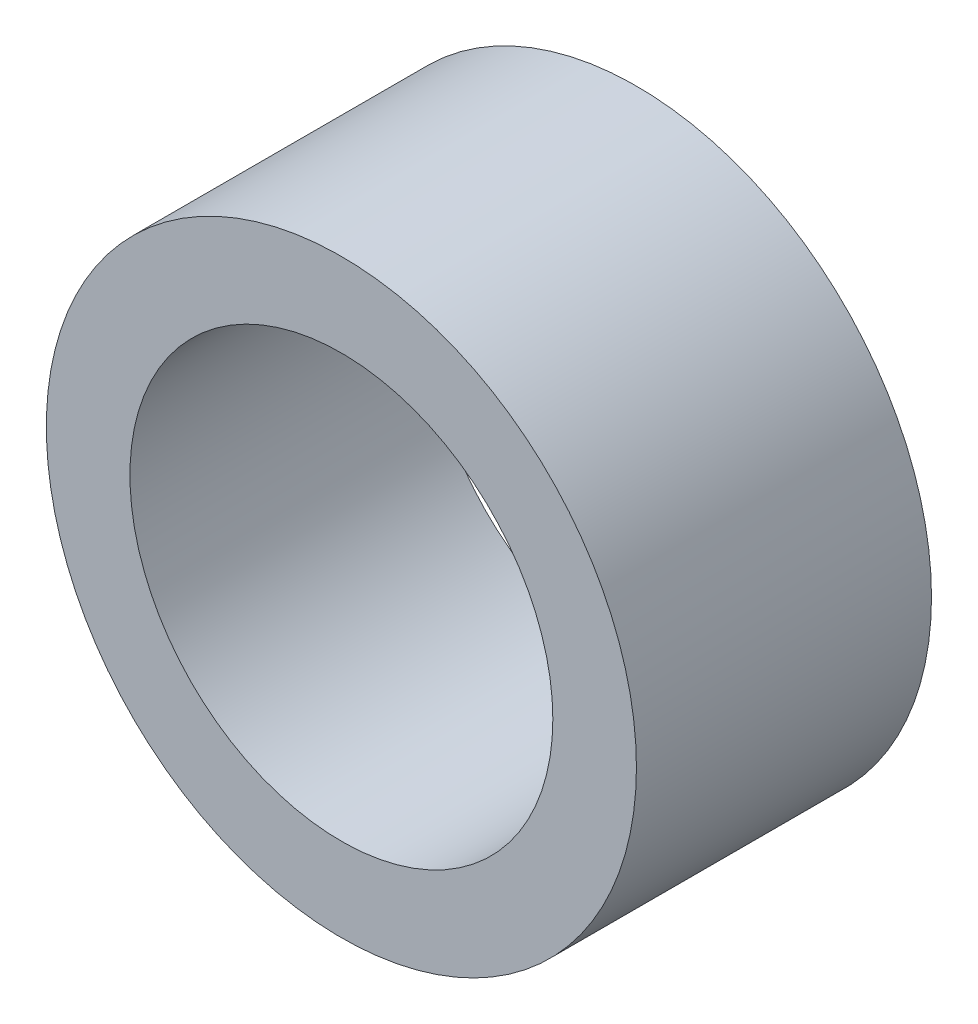
ISO-10303-21;
HEADER;
FILE_DESCRIPTION(('STEP AP214'),'2;1');
FILE_NAME('part.step','',(''),(''),'','','');
FILE_SCHEMA(('AUTOMOTIVE_DESIGN { 1 0 10303 214 1 1 1 1 }'));
ENDSEC;
DATA;
#1=APPLICATION_CONTEXT('core data for automotive mechanical design processes');
#2=APPLICATION_PROTOCOL_DEFINITION('international standard','automotive_design',2000,#1);
#3=PRODUCT_CONTEXT('',#1,'mechanical');
#4=PRODUCT('Part','Part','',(#3));
#5=PRODUCT_RELATED_PRODUCT_CATEGORY('part','',(#4));
#6=PRODUCT_DEFINITION_FORMATION('','',#4);
#7=PRODUCT_DEFINITION_CONTEXT('part definition',#1,'design');
#8=PRODUCT_DEFINITION('design','',#6,#7);
#9=PRODUCT_DEFINITION_SHAPE('','',#8);
#10=(LENGTH_UNIT() NAMED_UNIT(*) SI_UNIT(.MILLI.,.METRE.));
#11=(NAMED_UNIT(*) PLANE_ANGLE_UNIT() SI_UNIT($,.RADIAN.));
#12=(NAMED_UNIT(*) SI_UNIT($,.STERADIAN.) SOLID_ANGLE_UNIT());
#13=UNCERTAINTY_MEASURE_WITH_UNIT(LENGTH_MEASURE(1.E-05),#10,'distance_accuracy_value','');
#14=(GEOMETRIC_REPRESENTATION_CONTEXT(3) GLOBAL_UNCERTAINTY_ASSIGNED_CONTEXT((#13)) GLOBAL_UNIT_ASSIGNED_CONTEXT((#10,
#11,#12)) REPRESENTATION_CONTEXT('',''));
#15=CARTESIAN_POINT('',(0.,0.,0.));
#16=DIRECTION('',(0.,0.,1.));
#17=DIRECTION('',(1.,0.,0.));
#18=AXIS2_PLACEMENT_3D('',#15,#16,#17);
#19=CARTESIAN_POINT('',(0.,0.,3.));
#20=DIRECTION('',(0.,0.,1.));
#21=DIRECTION('',(1.,0.,0.));
#22=AXIS2_PLACEMENT_3D('',#19,#20,#21);
#23=PLANE('',#22);
#24=CARTESIAN_POINT('',(0.,0.,3.));
#25=DIRECTION('',(0.,0.,1.));
#26=DIRECTION('',(1.,0.,0.));
#27=AXIS2_PLACEMENT_3D('',#24,#25,#26);
#28=CIRCLE('',#27,3.);
#29=CARTESIAN_POINT('',(3.,0.,3.));
#30=VERTEX_POINT('',#29);
#31=EDGE_CURVE('E10',#30,#30,#28,.T.);
#32=ORIENTED_EDGE('',*,*,#31,.T.);
#33=EDGE_LOOP('',(#32));
#34=FACE_BOUND('',#33,.T.);
#35=CARTESIAN_POINT('',(0.,0.,3.));
#36=DIRECTION('',(0.,0.,1.));
#37=DIRECTION('',(1.,0.,0.));
#38=AXIS2_PLACEMENT_3D('',#35,#36,#37);
#39=CIRCLE('',#38,2.15);
#40=CARTESIAN_POINT('',(2.15,0.,3.));
#41=VERTEX_POINT('',#40);
#42=EDGE_CURVE('E42',#41,#41,#39,.T.);
#43=ORIENTED_EDGE('',*,*,#42,.F.);
#44=EDGE_LOOP('',(#43));
#45=FACE_BOUND('',#44,.T.);
#46=ADVANCED_FACE('F31',(#34,#45),#23,.T.);
#47=CARTESIAN_POINT('',(0.,0.,0.));
#48=DIRECTION('',(0.,0.,1.));
#49=DIRECTION('',(1.,0.,0.));
#50=AXIS2_PLACEMENT_3D('',#47,#48,#49);
#51=PLANE('',#50);
#52=CARTESIAN_POINT('',(0.,0.,0.));
#53=DIRECTION('',(0.,0.,1.));
#54=DIRECTION('',(1.,0.,0.));
#55=AXIS2_PLACEMENT_3D('',#52,#53,#54);
#56=CIRCLE('',#55,3.);
#57=CARTESIAN_POINT('',(3.,0.,0.));
#58=VERTEX_POINT('',#57);
#59=EDGE_CURVE('E35',#58,#58,#56,.T.);
#60=ORIENTED_EDGE('',*,*,#59,.F.);
#61=EDGE_LOOP('',(#60));
#62=FACE_BOUND('',#61,.T.);
#63=CARTESIAN_POINT('',(0.,0.,0.));
#64=DIRECTION('',(0.,0.,1.));
#65=DIRECTION('',(1.,0.,0.));
#66=AXIS2_PLACEMENT_3D('',#63,#64,#65);
#67=CIRCLE('',#66,2.15);
#68=CARTESIAN_POINT('',(2.15,0.,0.));
#69=VERTEX_POINT('',#68);
#70=EDGE_CURVE('E44',#69,#69,#67,.T.);
#71=ORIENTED_EDGE('',*,*,#70,.T.);
#72=EDGE_LOOP('',(#71));
#73=FACE_BOUND('',#72,.T.);
#74=ADVANCED_FACE('F54',(#62,#73),#51,.F.);
#75=CARTESIAN_POINT('',(0.,0.,3.));
#76=DIRECTION('',(0.,0.,-1.));
#77=DIRECTION('',(-1.,0.,0.));
#78=AXIS2_PLACEMENT_3D('',#75,#76,#77);
#79=CYLINDRICAL_SURFACE('',#78,3.);
#80=ORIENTED_EDGE('',*,*,#31,.F.);
#81=EDGE_LOOP('',(#80));
#82=FACE_BOUND('',#81,.T.);
#83=ORIENTED_EDGE('',*,*,#59,.T.);
#84=EDGE_LOOP('',(#83));
#85=FACE_BOUND('',#84,.T.);
#86=ADVANCED_FACE('F33',(#82,#85),#79,.T.);
#87=CARTESIAN_POINT('',(0.,0.,3.));
#88=DIRECTION('',(0.,0.,-1.));
#89=DIRECTION('',(-1.,0.,0.));
#90=AXIS2_PLACEMENT_3D('',#87,#88,#89);
#91=CYLINDRICAL_SURFACE('',#90,2.15);
#92=ORIENTED_EDGE('',*,*,#42,.T.);
#93=EDGE_LOOP('',(#92));
#94=FACE_BOUND('',#93,.T.);
#95=ORIENTED_EDGE('',*,*,#70,.F.);
#96=EDGE_LOOP('',(#95));
#97=FACE_BOUND('',#96,.T.);
#98=ADVANCED_FACE('F50',(#94,#97),#91,.F.);
#99=CLOSED_SHELL('',(#46,#74,#86,#98));
#100=MANIFOLD_SOLID_BREP('B2',#99);
#101=ADVANCED_BREP_SHAPE_REPRESENTATION('',(#18,#100),#14);
#102=SHAPE_DEFINITION_REPRESENTATION(#9,#101);
ENDSEC;
END-ISO-10303-21;
